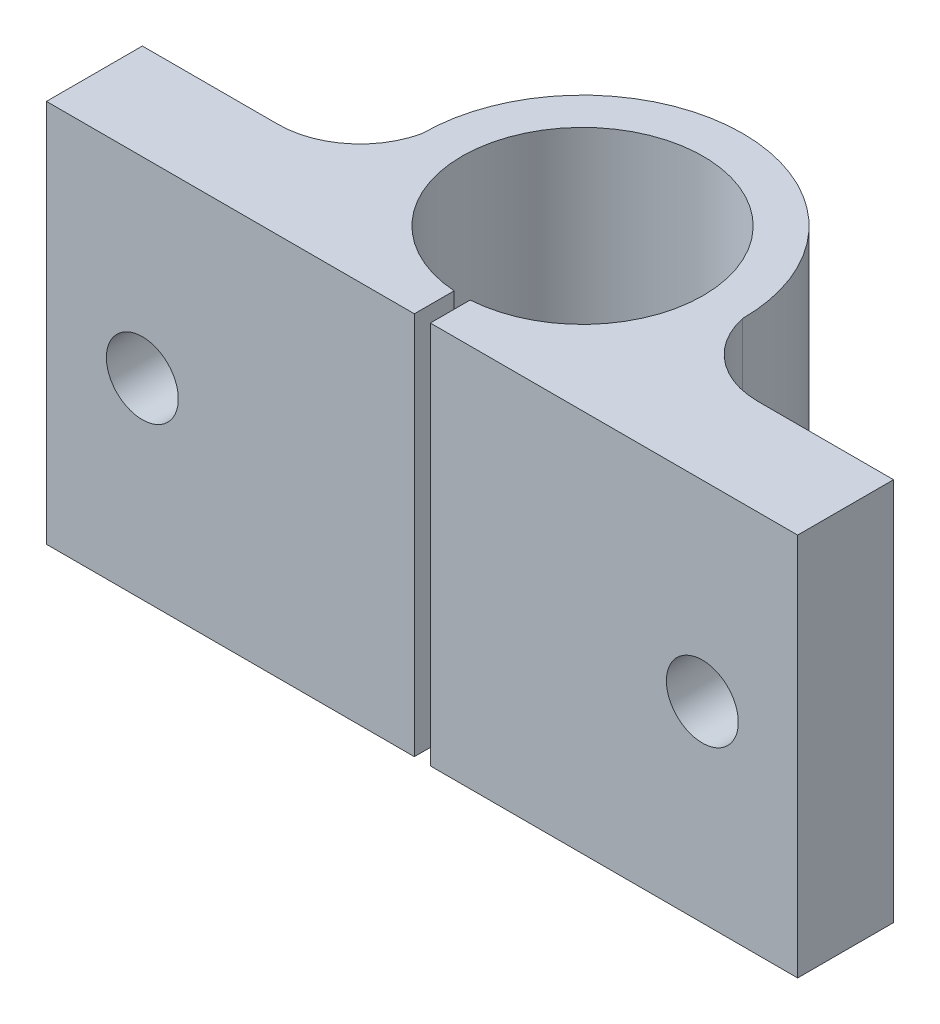
ISO-10303-21;
HEADER;
FILE_DESCRIPTION(('STEP AP214'),'2;1');
FILE_NAME('part.step','',(''),(''),'','','');
FILE_SCHEMA(('AUTOMOTIVE_DESIGN { 1 0 10303 214 1 1 1 1 }'));
ENDSEC;
DATA;
#1=APPLICATION_CONTEXT('core data for automotive mechanical design processes');
#2=APPLICATION_PROTOCOL_DEFINITION('international standard','automotive_design',2000,#1);
#3=PRODUCT_CONTEXT('',#1,'mechanical');
#4=PRODUCT('Part','Part','',(#3));
#5=PRODUCT_RELATED_PRODUCT_CATEGORY('part','',(#4));
#6=PRODUCT_DEFINITION_FORMATION('','',#4);
#7=PRODUCT_DEFINITION_CONTEXT('part definition',#1,'design');
#8=PRODUCT_DEFINITION('design','',#6,#7);
#9=PRODUCT_DEFINITION_SHAPE('','',#8);
#10=(LENGTH_UNIT() NAMED_UNIT(*) SI_UNIT(.MILLI.,.METRE.));
#11=(NAMED_UNIT(*) PLANE_ANGLE_UNIT() SI_UNIT($,.RADIAN.));
#12=(NAMED_UNIT(*) SI_UNIT($,.STERADIAN.) SOLID_ANGLE_UNIT());
#13=UNCERTAINTY_MEASURE_WITH_UNIT(LENGTH_MEASURE(1.E-05),#10,'distance_accuracy_value','');
#14=(GEOMETRIC_REPRESENTATION_CONTEXT(3) GLOBAL_UNCERTAINTY_ASSIGNED_CONTEXT((#13)) GLOBAL_UNIT_ASSIGNED_CONTEXT((#10,
#11,#12)) REPRESENTATION_CONTEXT('',''));
#15=CARTESIAN_POINT('',(0.,0.,0.));
#16=DIRECTION('',(0.,0.,1.));
#17=DIRECTION('',(1.,0.,0.));
#18=AXIS2_PLACEMENT_3D('',#15,#16,#17);
#19=CARTESIAN_POINT('',(0.,0.,0.));
#20=DIRECTION('',(0.,0.,1.));
#21=DIRECTION('',(1.,0.,0.));
#22=AXIS2_PLACEMENT_3D('',#19,#20,#21);
#23=PLANE('',#22);
#24=CARTESIAN_POINT('',(41.0372666212457,12.,0.));
#25=DIRECTION('',(0.,0.,-1.));
#26=DIRECTION('',(-1.,0.,0.));
#27=AXIS2_PLACEMENT_3D('',#24,#25,#26);
#28=CIRCLE('',#27,2.25000000000006);
#29=CARTESIAN_POINT('',(38.7872666212456,12.,0.));
#30=VERTEX_POINT('',#29);
#31=EDGE_CURVE('E225',#30,#30,#28,.T.);
#32=ORIENTED_EDGE('',*,*,#31,.T.);
#33=EDGE_LOOP('',(#32));
#34=FACE_BOUND('',#33,.T.);
#35=DIRECTION('',(0.,-1.,0.));
#36=VECTOR('',#35,1.);
#37=CARTESIAN_POINT('',(24.0186333106229,24.,0.));
#38=LINE('',#37,#36);
#39=CARTESIAN_POINT('',(24.0186333106229,24.,0.));
#40=VERTEX_POINT('',#39);
#41=CARTESIAN_POINT('',(24.0186333106229,0.,0.));
#42=VERTEX_POINT('',#41);
#43=EDGE_CURVE('E237',#40,#42,#38,.T.);
#44=ORIENTED_EDGE('',*,*,#43,.T.);
#45=DIRECTION('',(1.,0.,0.));
#46=VECTOR('',#45,1.);
#47=CARTESIAN_POINT('',(0.,0.,0.));
#48=LINE('',#47,#46);
#49=CARTESIAN_POINT('',(47.,0.,0.));
#50=VERTEX_POINT('',#49);
#51=EDGE_CURVE('E250',#42,#50,#48,.T.);
#52=ORIENTED_EDGE('',*,*,#51,.T.);
#53=DIRECTION('',(0.,1.,0.));
#54=VECTOR('',#53,1.);
#55=CARTESIAN_POINT('',(47.,0.,0.));
#56=LINE('',#55,#54);
#57=CARTESIAN_POINT('',(47.,24.,0.));
#58=VERTEX_POINT('',#57);
#59=EDGE_CURVE('E176',#50,#58,#56,.T.);
#60=ORIENTED_EDGE('',*,*,#59,.T.);
#61=DIRECTION('',(1.,0.,0.));
#62=VECTOR('',#61,1.);
#63=CARTESIAN_POINT('',(0.,24.,0.));
#64=LINE('',#63,#62);
#65=EDGE_CURVE('E150',#40,#58,#64,.T.);
#66=ORIENTED_EDGE('',*,*,#65,.F.);
#67=EDGE_LOOP('',(#44,#52,#60,#66));
#68=FACE_BOUND('',#67,.T.);
#69=ADVANCED_FACE('F35',(#34,#68),#23,.T.);
#70=CARTESIAN_POINT('',(0.,0.,-6.));
#71=DIRECTION('',(-1.,0.,0.));
#72=DIRECTION('',(0.,0.,1.));
#73=AXIS2_PLACEMENT_3D('',#70,#71,#72);
#74=PLANE('',#73);
#75=DIRECTION('',(0.,0.,1.));
#76=VECTOR('',#75,1.);
#77=CARTESIAN_POINT('',(0.,24.,-6.));
#78=LINE('',#77,#76);
#79=CARTESIAN_POINT('',(0.,24.,-6.));
#80=VERTEX_POINT('',#79);
#81=CARTESIAN_POINT('',(0.,24.,0.));
#82=VERTEX_POINT('',#81);
#83=EDGE_CURVE('E147',#80,#82,#78,.T.);
#84=ORIENTED_EDGE('',*,*,#83,.F.);
#85=DIRECTION('',(0.,1.,0.));
#86=VECTOR('',#85,1.);
#87=CARTESIAN_POINT('',(0.,0.,-6.));
#88=LINE('',#87,#86);
#89=CARTESIAN_POINT('',(0.,0.,-6.));
#90=VERTEX_POINT('',#89);
#91=EDGE_CURVE('E11',#90,#80,#88,.T.);
#92=ORIENTED_EDGE('',*,*,#91,.F.);
#93=DIRECTION('',(0.,0.,1.));
#94=VECTOR('',#93,1.);
#95=CARTESIAN_POINT('',(0.,0.,-6.));
#96=LINE('',#95,#94);
#97=CARTESIAN_POINT('',(0.,0.,0.));
#98=VERTEX_POINT('',#97);
#99=EDGE_CURVE('E169',#90,#98,#96,.T.);
#100=ORIENTED_EDGE('',*,*,#99,.T.);
#101=DIRECTION('',(0.,1.,0.));
#102=VECTOR('',#101,1.);
#103=CARTESIAN_POINT('',(0.,0.,0.));
#104=LINE('',#103,#102);
#105=EDGE_CURVE('E39',#98,#82,#104,.T.);
#106=ORIENTED_EDGE('',*,*,#105,.T.);
#107=EDGE_LOOP('',(#84,#92,#100,#106));
#108=FACE_BOUND('',#107,.T.);
#109=ADVANCED_FACE('F37',(#108),#74,.T.);
#110=CARTESIAN_POINT('',(8.50000000000001,0.,-6.));
#111=DIRECTION('',(0.,0.,-1.));
#112=DIRECTION('',(-1.,0.,0.));
#113=AXIS2_PLACEMENT_3D('',#110,#111,#112);
#114=PLANE('',#113);
#115=CARTESIAN_POINT('',(6.,12.,-6.00000000000001));
#116=DIRECTION('',(0.,0.,-1.));
#117=DIRECTION('',(-1.,0.,0.));
#118=AXIS2_PLACEMENT_3D('',#115,#116,#117);
#119=CIRCLE('',#118,2.25000000000007);
#120=CARTESIAN_POINT('',(3.74999999999994,12.,-6.00000000000001));
#121=VERTEX_POINT('',#120);
#122=EDGE_CURVE('E220',#121,#121,#119,.T.);
#123=ORIENTED_EDGE('',*,*,#122,.F.);
#124=EDGE_LOOP('',(#123));
#125=FACE_BOUND('',#124,.T.);
#126=DIRECTION('',(-1.,0.,0.));
#127=VECTOR('',#126,1.);
#128=CARTESIAN_POINT('',(8.50000000000001,24.,-6.));
#129=LINE('',#128,#127);
#130=CARTESIAN_POINT('',(8.50000000000001,24.,-6.00000000000002));
#131=VERTEX_POINT('',#130);
#132=EDGE_CURVE('E167',#131,#80,#129,.T.);
#133=ORIENTED_EDGE('',*,*,#132,.F.);
#134=DIRECTION('',(0.,1.,0.));
#135=VECTOR('',#134,1.);
#136=CARTESIAN_POINT('',(8.50000000000001,0.,-6.00000000000002));
#137=LINE('',#136,#135);
#138=CARTESIAN_POINT('',(8.50000000000001,0.,-6.00000000000002));
#139=VERTEX_POINT('',#138);
#140=EDGE_CURVE('E44',#139,#131,#137,.T.);
#141=ORIENTED_EDGE('',*,*,#140,.F.);
#142=DIRECTION('',(-1.,0.,0.));
#143=VECTOR('',#142,1.);
#144=CARTESIAN_POINT('',(8.50000000000001,0.,-6.));
#145=LINE('',#144,#143);
#146=EDGE_CURVE('E137',#139,#90,#145,.T.);
#147=ORIENTED_EDGE('',*,*,#146,.T.);
#148=ORIENTED_EDGE('',*,*,#91,.T.);
#149=EDGE_LOOP('',(#133,#141,#147,#148));
#150=FACE_BOUND('',#149,.T.);
#151=ADVANCED_FACE('F189',(#125,#150),#114,.T.);
#152=CARTESIAN_POINT('',(8.50000000000001,0.,-11.1210427356607));
#153=DIRECTION('',(0.,1.,0.));
#154=DIRECTION('',(0.,0.,1.));
#155=AXIS2_PLACEMENT_3D('',#152,#153,#154);
#156=CYLINDRICAL_SURFACE('',#155,5.12104273566066);
#157=CARTESIAN_POINT('',(8.50000000000001,24.,-11.1210427356607));
#158=DIRECTION('',(0.,-1.,0.));
#159=DIRECTION('',(0.,0.,-1.));
#160=AXIS2_PLACEMENT_3D('',#157,#158,#159);
#161=CIRCLE('',#160,5.12104273566066);
#162=CARTESIAN_POINT('',(13.4959473897421,24.,-9.99605901160399));
#163=VERTEX_POINT('',#162);
#164=EDGE_CURVE('E123',#163,#131,#161,.T.);
#165=ORIENTED_EDGE('',*,*,#164,.F.);
#166=DIRECTION('',(0.,1.,0.));
#167=VECTOR('',#166,1.);
#168=CARTESIAN_POINT('',(13.4959473897421,0.,-9.99605901160399));
#169=LINE('',#168,#167);
#170=CARTESIAN_POINT('',(13.4959473897421,0.,-9.99605901160399));
#171=VERTEX_POINT('',#170);
#172=EDGE_CURVE('E117',#171,#163,#169,.T.);
#173=ORIENTED_EDGE('',*,*,#172,.F.);
#174=CARTESIAN_POINT('',(8.50000000000001,0.,-11.1210427356607));
#175=DIRECTION('',(0.,-1.,0.));
#176=DIRECTION('',(0.,0.,-1.));
#177=AXIS2_PLACEMENT_3D('',#174,#175,#176);
#178=CIRCLE('',#177,5.12104273566066);
#179=EDGE_CURVE('E120',#171,#139,#178,.T.);
#180=ORIENTED_EDGE('',*,*,#179,.T.);
#181=ORIENTED_EDGE('',*,*,#140,.T.);
#182=EDGE_LOOP('',(#165,#173,#180,#181));
#183=FACE_BOUND('',#182,.T.);
#184=ADVANCED_FACE('F119',(#183),#156,.F.);
#185=CARTESIAN_POINT('',(23.5186333106229,0.,-10.0227213844719));
#186=DIRECTION('',(0.,1.,0.));
#187=DIRECTION('',(0.,0.,1.));
#188=AXIS2_PLACEMENT_3D('',#185,#186,#187);
#189=CYLINDRICAL_SURFACE('',#188,10.0227213844719);
#190=CARTESIAN_POINT('',(23.5186333106229,24.,-10.0227213844719));
#191=DIRECTION('',(0.,1.,0.));
#192=DIRECTION('',(0.,0.,1.));
#193=AXIS2_PLACEMENT_3D('',#190,#191,#192);
#194=CIRCLE('',#193,10.0227213844719);
#195=CARTESIAN_POINT('',(33.5413546555968,24.,-10.021831577252));
#196=VERTEX_POINT('',#195);
#197=EDGE_CURVE('E164',#196,#163,#194,.T.);
#198=ORIENTED_EDGE('',*,*,#197,.F.);
#199=DIRECTION('',(0.,1.,0.));
#200=VECTOR('',#199,1.);
#201=CARTESIAN_POINT('',(33.5413546555968,0.,-10.021831577252));
#202=LINE('',#201,#200);
#203=CARTESIAN_POINT('',(33.5413546555968,0.,-10.021831577252));
#204=VERTEX_POINT('',#203);
#205=EDGE_CURVE('E128',#204,#196,#202,.T.);
#206=ORIENTED_EDGE('',*,*,#205,.F.);
#207=CARTESIAN_POINT('',(23.5186333106229,0.,-10.0227213844719));
#208=DIRECTION('',(0.,1.,0.));
#209=DIRECTION('',(0.,0.,1.));
#210=AXIS2_PLACEMENT_3D('',#207,#208,#209);
#211=CIRCLE('',#210,10.0227213844719);
#212=EDGE_CURVE('E135',#204,#171,#211,.T.);
#213=ORIENTED_EDGE('',*,*,#212,.T.);
#214=ORIENTED_EDGE('',*,*,#172,.T.);
#215=EDGE_LOOP('',(#198,#206,#213,#214));
#216=FACE_BOUND('',#215,.T.);
#217=ADVANCED_FACE('F139',(#216),#189,.T.);
#218=CARTESIAN_POINT('',(38.5000000000001,0.,-11.0677523541657));
#219=DIRECTION('',(0.,1.,0.));
#220=DIRECTION('',(0.,0.,1.));
#221=AXIS2_PLACEMENT_3D('',#218,#219,#220);
#222=CYLINDRICAL_SURFACE('',#221,5.06775235416579);
#223=CARTESIAN_POINT('',(38.5000000000001,24.,-11.0677523541657));
#224=DIRECTION('',(0.,-1.,0.));
#225=DIRECTION('',(0.,0.,-1.));
#226=AXIS2_PLACEMENT_3D('',#223,#224,#225);
#227=CIRCLE('',#226,5.06775235416579);
#228=CARTESIAN_POINT('',(38.5,24.,-6.00000000000001));
#229=VERTEX_POINT('',#228);
#230=EDGE_CURVE('E161',#229,#196,#227,.T.);
#231=ORIENTED_EDGE('',*,*,#230,.F.);
#232=DIRECTION('',(0.,1.,0.));
#233=VECTOR('',#232,1.);
#234=CARTESIAN_POINT('',(38.5,0.,-6.00000000000001));
#235=LINE('',#234,#233);
#236=CARTESIAN_POINT('',(38.5,0.,-6.00000000000001));
#237=VERTEX_POINT('',#236);
#238=EDGE_CURVE('E173',#237,#229,#235,.T.);
#239=ORIENTED_EDGE('',*,*,#238,.F.);
#240=CARTESIAN_POINT('',(38.5000000000001,0.,-11.0677523541657));
#241=DIRECTION('',(0.,-1.,0.));
#242=DIRECTION('',(0.,0.,-1.));
#243=AXIS2_PLACEMENT_3D('',#240,#241,#242);
#244=CIRCLE('',#243,5.06775235416579);
#245=EDGE_CURVE('E140',#237,#204,#244,.T.);
#246=ORIENTED_EDGE('',*,*,#245,.T.);
#247=ORIENTED_EDGE('',*,*,#205,.T.);
#248=EDGE_LOOP('',(#231,#239,#246,#247));
#249=FACE_BOUND('',#248,.T.);
#250=ADVANCED_FACE('F308',(#249),#222,.F.);
#251=CARTESIAN_POINT('',(47.,0.,-6.));
#252=DIRECTION('',(0.,0.,-1.));
#253=DIRECTION('',(-1.,0.,0.));
#254=AXIS2_PLACEMENT_3D('',#251,#252,#253);
#255=PLANE('',#254);
#256=CARTESIAN_POINT('',(41.0372666212457,12.,-6.00000000000001));
#257=DIRECTION('',(0.,0.,-1.));
#258=DIRECTION('',(-1.,0.,0.));
#259=AXIS2_PLACEMENT_3D('',#256,#257,#258);
#260=CIRCLE('',#259,2.25000000000006);
#261=CARTESIAN_POINT('',(38.7872666212456,12.,-6.00000000000001));
#262=VERTEX_POINT('',#261);
#263=EDGE_CURVE('E304',#262,#262,#260,.T.);
#264=ORIENTED_EDGE('',*,*,#263,.F.);
#265=EDGE_LOOP('',(#264));
#266=FACE_BOUND('',#265,.T.);
#267=DIRECTION('',(-1.,0.,0.));
#268=VECTOR('',#267,1.);
#269=CARTESIAN_POINT('',(47.,24.,-6.));
#270=LINE('',#269,#268);
#271=CARTESIAN_POINT('',(47.,24.,-6.));
#272=VERTEX_POINT('',#271);
#273=EDGE_CURVE('E158',#272,#229,#270,.T.);
#274=ORIENTED_EDGE('',*,*,#273,.F.);
#275=DIRECTION('',(0.,1.,0.));
#276=VECTOR('',#275,1.);
#277=CARTESIAN_POINT('',(47.,0.,-6.));
#278=LINE('',#277,#276);
#279=CARTESIAN_POINT('',(47.,0.,-6.));
#280=VERTEX_POINT('',#279);
#281=EDGE_CURVE('E175',#280,#272,#278,.T.);
#282=ORIENTED_EDGE('',*,*,#281,.F.);
#283=DIRECTION('',(-1.,0.,0.));
#284=VECTOR('',#283,1.);
#285=CARTESIAN_POINT('',(47.,0.,-6.));
#286=LINE('',#285,#284);
#287=EDGE_CURVE('E142',#280,#237,#286,.T.);
#288=ORIENTED_EDGE('',*,*,#287,.T.);
#289=ORIENTED_EDGE('',*,*,#238,.T.);
#290=EDGE_LOOP('',(#274,#282,#288,#289));
#291=FACE_BOUND('',#290,.T.);
#292=ADVANCED_FACE('F214',(#266,#291),#255,.T.);
#293=CARTESIAN_POINT('',(47.,0.,0.));
#294=DIRECTION('',(1.,0.,0.));
#295=DIRECTION('',(0.,0.,-1.));
#296=AXIS2_PLACEMENT_3D('',#293,#294,#295);
#297=PLANE('',#296);
#298=DIRECTION('',(0.,0.,-1.));
#299=VECTOR('',#298,1.);
#300=CARTESIAN_POINT('',(47.,24.,0.));
#301=LINE('',#300,#299);
#302=EDGE_CURVE('E155',#58,#272,#301,.T.);
#303=ORIENTED_EDGE('',*,*,#302,.F.);
#304=ORIENTED_EDGE('',*,*,#59,.F.);
#305=DIRECTION('',(0.,0.,-1.));
#306=VECTOR('',#305,1.);
#307=CARTESIAN_POINT('',(47.,0.,0.));
#308=LINE('',#307,#306);
#309=EDGE_CURVE('E253',#50,#280,#308,.T.);
#310=ORIENTED_EDGE('',*,*,#309,.T.);
#311=ORIENTED_EDGE('',*,*,#281,.T.);
#312=EDGE_LOOP('',(#303,#304,#310,#311));
#313=FACE_BOUND('',#312,.T.);
#314=ADVANCED_FACE('F207',(#313),#297,.T.);
#315=CARTESIAN_POINT('',(6.,12.,0.));
#316=DIRECTION('',(0.,0.,-1.));
#317=DIRECTION('',(-1.,0.,0.));
#318=AXIS2_PLACEMENT_3D('',#315,#316,#317);
#319=CIRCLE('',#318,2.25000000000007);
#320=CARTESIAN_POINT('',(3.74999999999994,12.,0.));
#321=VERTEX_POINT('',#320);
#322=EDGE_CURVE('E218',#321,#321,#319,.T.);
#323=ORIENTED_EDGE('',*,*,#322,.T.);
#324=EDGE_LOOP('',(#323));
#325=FACE_BOUND('',#324,.T.);
#326=DIRECTION('',(0.,-1.,0.));
#327=VECTOR('',#326,1.);
#328=CARTESIAN_POINT('',(23.0186333106229,24.,0.));
#329=LINE('',#328,#327);
#330=CARTESIAN_POINT('',(23.0186333106229,24.,0.));
#331=VERTEX_POINT('',#330);
#332=CARTESIAN_POINT('',(23.0186333106229,0.,0.));
#333=VERTEX_POINT('',#332);
#334=EDGE_CURVE('E185',#331,#333,#329,.T.);
#335=ORIENTED_EDGE('',*,*,#334,.F.);
#336=EDGE_CURVE('E152',#82,#331,#64,.T.);
#337=ORIENTED_EDGE('',*,*,#336,.F.);
#338=ORIENTED_EDGE('',*,*,#105,.F.);
#339=EDGE_CURVE('E251',#98,#333,#48,.T.);
#340=ORIENTED_EDGE('',*,*,#339,.T.);
#341=EDGE_LOOP('',(#335,#337,#338,#340));
#342=FACE_BOUND('',#341,.T.);
#343=ADVANCED_FACE('F183',(#325,#342),#23,.T.);
#344=CARTESIAN_POINT('',(38.5000000000001,0.,-11.0677523541657));
#345=DIRECTION('',(0.,-1.,0.));
#346=DIRECTION('',(0.,0.,-1.));
#347=AXIS2_PLACEMENT_3D('',#344,#345,#346);
#348=PLANE('',#347);
#349=CARTESIAN_POINT('',(23.5186333106229,0.,-10.022721384472));
#350=DIRECTION('',(0.,1.,0.));
#351=DIRECTION('',(0.,0.,1.));
#352=AXIS2_PLACEMENT_3D('',#349,#350,#351);
#353=CIRCLE('',#352,7.55000000000005);
#354=CARTESIAN_POINT('',(24.0186333106229,0.,-2.48929586881175));
#355=VERTEX_POINT('',#354);
#356=CARTESIAN_POINT('',(23.0186333106229,0.,-2.48929586881175));
#357=VERTEX_POINT('',#356);
#358=EDGE_CURVE('E222',#355,#357,#353,.T.);
#359=ORIENTED_EDGE('',*,*,#358,.T.);
#360=DIRECTION('',(0.,0.,-1.));
#361=VECTOR('',#360,1.);
#362=CARTESIAN_POINT('',(23.0186333106229,0.,0.));
#363=LINE('',#362,#361);
#364=EDGE_CURVE('E235',#333,#357,#363,.T.);
#365=ORIENTED_EDGE('',*,*,#364,.F.);
#366=ORIENTED_EDGE('',*,*,#339,.F.);
#367=ORIENTED_EDGE('',*,*,#99,.F.);
#368=ORIENTED_EDGE('',*,*,#146,.F.);
#369=ORIENTED_EDGE('',*,*,#179,.F.);
#370=ORIENTED_EDGE('',*,*,#212,.F.);
#371=ORIENTED_EDGE('',*,*,#245,.F.);
#372=ORIENTED_EDGE('',*,*,#287,.F.);
#373=ORIENTED_EDGE('',*,*,#309,.F.);
#374=ORIENTED_EDGE('',*,*,#51,.F.);
#375=DIRECTION('',(0.,0.,1.));
#376=VECTOR('',#375,1.);
#377=CARTESIAN_POINT('',(24.0186333106229,0.,-2.48929586881175));
#378=LINE('',#377,#376);
#379=EDGE_CURVE('E230',#355,#42,#378,.T.);
#380=ORIENTED_EDGE('',*,*,#379,.F.);
#381=EDGE_LOOP('',(#359,#365,#366,#367,#368,#369,#370,#371,#372,#373,#374,#380));
#382=FACE_BOUND('',#381,.T.);
#383=ADVANCED_FACE('F133',(#382),#348,.T.);
#384=CARTESIAN_POINT('',(38.5000000000001,24.,-11.0677523541657));
#385=DIRECTION('',(0.,-1.,0.));
#386=DIRECTION('',(0.,0.,-1.));
#387=AXIS2_PLACEMENT_3D('',#384,#385,#386);
#388=PLANE('',#387);
#389=DIRECTION('',(0.,0.,-1.));
#390=VECTOR('',#389,1.);
#391=CARTESIAN_POINT('',(23.0186333106229,24.,0.));
#392=LINE('',#391,#390);
#393=CARTESIAN_POINT('',(23.0186333106229,24.,-2.48929586881175));
#394=VERTEX_POINT('',#393);
#395=EDGE_CURVE('E234',#331,#394,#392,.T.);
#396=ORIENTED_EDGE('',*,*,#395,.T.);
#397=CARTESIAN_POINT('',(23.5186333106229,24.,-10.022721384472));
#398=DIRECTION('',(0.,1.,0.));
#399=DIRECTION('',(0.,0.,1.));
#400=AXIS2_PLACEMENT_3D('',#397,#398,#399);
#401=CIRCLE('',#400,7.55000000000005);
#402=CARTESIAN_POINT('',(24.0186333106229,24.,-2.48929586881175));
#403=VERTEX_POINT('',#402);
#404=EDGE_CURVE('E52',#403,#394,#401,.T.);
#405=ORIENTED_EDGE('',*,*,#404,.F.);
#406=DIRECTION('',(0.,0.,1.));
#407=VECTOR('',#406,1.);
#408=CARTESIAN_POINT('',(24.0186333106229,24.,-2.48929586881175));
#409=LINE('',#408,#407);
#410=EDGE_CURVE('E231',#403,#40,#409,.T.);
#411=ORIENTED_EDGE('',*,*,#410,.T.);
#412=ORIENTED_EDGE('',*,*,#65,.T.);
#413=ORIENTED_EDGE('',*,*,#302,.T.);
#414=ORIENTED_EDGE('',*,*,#273,.T.);
#415=ORIENTED_EDGE('',*,*,#230,.T.);
#416=ORIENTED_EDGE('',*,*,#197,.T.);
#417=ORIENTED_EDGE('',*,*,#164,.T.);
#418=ORIENTED_EDGE('',*,*,#132,.T.);
#419=ORIENTED_EDGE('',*,*,#83,.T.);
#420=ORIENTED_EDGE('',*,*,#336,.T.);
#421=EDGE_LOOP('',(#396,#405,#411,#412,#413,#414,#415,#416,#417,#418,#419,#420));
#422=FACE_BOUND('',#421,.T.);
#423=ADVANCED_FACE('F188',(#422),#388,.F.);
#424=CARTESIAN_POINT('',(24.0186333106229,24.,-2.48929586881175));
#425=DIRECTION('',(1.,0.,0.));
#426=DIRECTION('',(0.,0.,-1.));
#427=AXIS2_PLACEMENT_3D('',#424,#425,#426);
#428=PLANE('',#427);
#429=ORIENTED_EDGE('',*,*,#379,.T.);
#430=ORIENTED_EDGE('',*,*,#43,.F.);
#431=ORIENTED_EDGE('',*,*,#410,.F.);
#432=DIRECTION('',(0.,-1.,0.));
#433=VECTOR('',#432,1.);
#434=CARTESIAN_POINT('',(24.0186333106229,24.,-2.48929586881175));
#435=LINE('',#434,#433);
#436=EDGE_CURVE('E151',#403,#355,#435,.T.);
#437=ORIENTED_EDGE('',*,*,#436,.T.);
#438=EDGE_LOOP('',(#429,#430,#431,#437));
#439=FACE_BOUND('',#438,.T.);
#440=ADVANCED_FACE('F279',(#439),#428,.F.);
#441=CARTESIAN_POINT('',(23.0186333106229,24.,0.));
#442=DIRECTION('',(-1.,0.,0.));
#443=DIRECTION('',(0.,0.,1.));
#444=AXIS2_PLACEMENT_3D('',#441,#442,#443);
#445=PLANE('',#444);
#446=ORIENTED_EDGE('',*,*,#364,.T.);
#447=DIRECTION('',(0.,-1.,0.));
#448=VECTOR('',#447,1.);
#449=CARTESIAN_POINT('',(23.0186333106229,24.,-2.48929586881175));
#450=LINE('',#449,#448);
#451=EDGE_CURVE('E244',#394,#357,#450,.T.);
#452=ORIENTED_EDGE('',*,*,#451,.F.);
#453=ORIENTED_EDGE('',*,*,#395,.F.);
#454=ORIENTED_EDGE('',*,*,#334,.T.);
#455=EDGE_LOOP('',(#446,#452,#453,#454));
#456=FACE_BOUND('',#455,.T.);
#457=ADVANCED_FACE('F281',(#456),#445,.F.);
#458=CARTESIAN_POINT('',(23.5186333106229,0.,-10.022721384472));
#459=DIRECTION('',(0.,1.,0.));
#460=DIRECTION('',(0.,0.,1.));
#461=AXIS2_PLACEMENT_3D('',#458,#459,#460);
#462=CYLINDRICAL_SURFACE('',#461,7.55000000000005);
#463=ORIENTED_EDGE('',*,*,#404,.T.);
#464=ORIENTED_EDGE('',*,*,#451,.T.);
#465=ORIENTED_EDGE('',*,*,#358,.F.);
#466=ORIENTED_EDGE('',*,*,#436,.F.);
#467=EDGE_LOOP('',(#463,#464,#465,#466));
#468=FACE_BOUND('',#467,.T.);
#469=ADVANCED_FACE('F278',(#468),#462,.F.);
#470=CARTESIAN_POINT('',(6.,12.,-6.00000000000001));
#471=DIRECTION('',(0.,0.,-1.));
#472=DIRECTION('',(-1.,0.,0.));
#473=AXIS2_PLACEMENT_3D('',#470,#471,#472);
#474=CYLINDRICAL_SURFACE('',#473,2.25000000000007);
#475=ORIENTED_EDGE('',*,*,#322,.F.);
#476=EDGE_LOOP('',(#475));
#477=FACE_BOUND('',#476,.T.);
#478=ORIENTED_EDGE('',*,*,#122,.T.);
#479=EDGE_LOOP('',(#478));
#480=FACE_BOUND('',#479,.T.);
#481=ADVANCED_FACE('F292',(#477,#480),#474,.F.);
#482=CARTESIAN_POINT('',(41.0372666212457,12.,-6.00000000000001));
#483=DIRECTION('',(0.,0.,-1.));
#484=DIRECTION('',(-1.,0.,0.));
#485=AXIS2_PLACEMENT_3D('',#482,#483,#484);
#486=CYLINDRICAL_SURFACE('',#485,2.25000000000006);
#487=ORIENTED_EDGE('',*,*,#31,.F.);
#488=EDGE_LOOP('',(#487));
#489=FACE_BOUND('',#488,.T.);
#490=ORIENTED_EDGE('',*,*,#263,.T.);
#491=EDGE_LOOP('',(#490));
#492=FACE_BOUND('',#491,.T.);
#493=ADVANCED_FACE('F295',(#489,#492),#486,.F.);
#494=CLOSED_SHELL('',(#69,#109,#151,#184,#217,#250,#292,#314,#343,#383,#423,#440,#457,#469,#481,#493));
#495=MANIFOLD_SOLID_BREP('B2',#494);
#496=ADVANCED_BREP_SHAPE_REPRESENTATION('',(#18,#495),#14);
#497=SHAPE_DEFINITION_REPRESENTATION(#9,#496);
ENDSEC;
END-ISO-10303-21;
